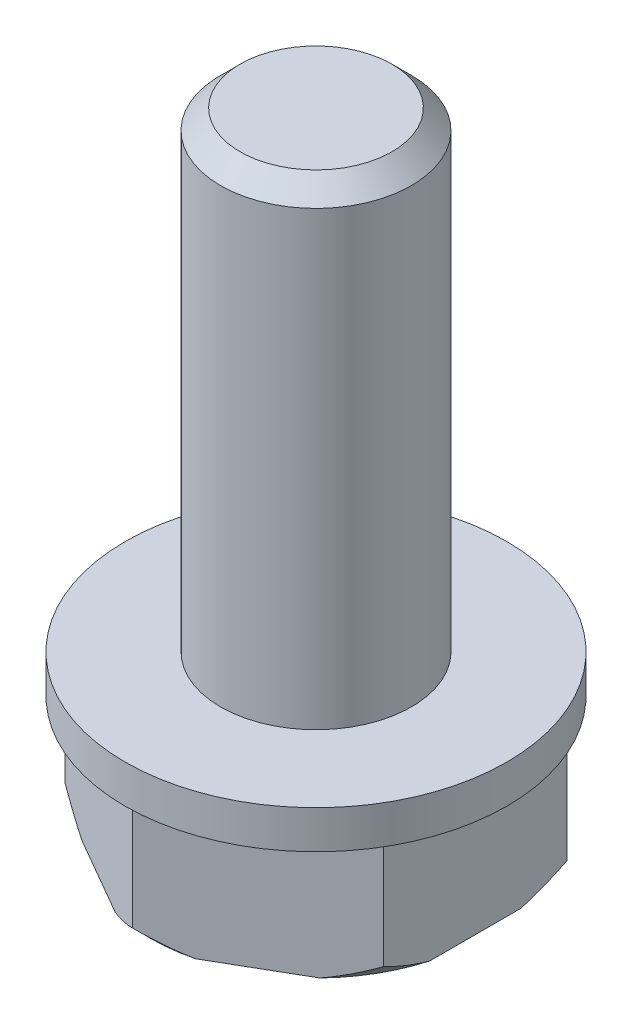
ISO-10303-21;
HEADER;
FILE_DESCRIPTION(('STEP AP214'),'2;1');
FILE_NAME('part.step','',(''),(''),'','','');
FILE_SCHEMA(('AUTOMOTIVE_DESIGN { 1 0 10303 214 1 1 1 1 }'));
ENDSEC;
DATA;
#1=APPLICATION_CONTEXT('core data for automotive mechanical design processes');
#2=APPLICATION_PROTOCOL_DEFINITION('international standard','automotive_design',2000,#1);
#3=PRODUCT_CONTEXT('',#1,'mechanical');
#4=PRODUCT('Part','Part','',(#3));
#5=PRODUCT_RELATED_PRODUCT_CATEGORY('part','',(#4));
#6=PRODUCT_DEFINITION_FORMATION('','',#4);
#7=PRODUCT_DEFINITION_CONTEXT('part definition',#1,'design');
#8=PRODUCT_DEFINITION('design','',#6,#7);
#9=PRODUCT_DEFINITION_SHAPE('','',#8);
#10=(LENGTH_UNIT() NAMED_UNIT(*) SI_UNIT(.MILLI.,.METRE.));
#11=(NAMED_UNIT(*) PLANE_ANGLE_UNIT() SI_UNIT($,.RADIAN.));
#12=(NAMED_UNIT(*) SI_UNIT($,.STERADIAN.) SOLID_ANGLE_UNIT());
#13=UNCERTAINTY_MEASURE_WITH_UNIT(LENGTH_MEASURE(1.E-05),#10,'distance_accuracy_value','');
#14=(GEOMETRIC_REPRESENTATION_CONTEXT(3) GLOBAL_UNCERTAINTY_ASSIGNED_CONTEXT((#13)) GLOBAL_UNIT_ASSIGNED_CONTEXT((#10,
#11,#12)) REPRESENTATION_CONTEXT('',''));
#15=CARTESIAN_POINT('',(0.,0.,0.));
#16=DIRECTION('',(0.,0.,1.));
#17=DIRECTION('',(1.,0.,0.));
#18=AXIS2_PLACEMENT_3D('',#15,#16,#17);
#19=CARTESIAN_POINT('',(-12.6776695296637,96.,-20.5644208756118));
#20=DIRECTION('',(-0.5,0.,0.866025403784439));
#21=DIRECTION('',(0.866025403784439,0.,0.5));
#22=AXIS2_PLACEMENT_3D('',#19,#20,#21);
#23=PLANE('',#22);
#24=DIRECTION('',(0.,-1.,0.));
#25=VECTOR('',#24,1.);
#26=CARTESIAN_POINT('',(-12.6776695296637,96.,-20.5644208756118));
#27=LINE('',#26,#25);
#28=CARTESIAN_POINT('',(-12.6776695296637,50.,-20.5644208756118));
#29=VERTEX_POINT('',#28);
#30=CARTESIAN_POINT('',(-12.6776695296637,46.5735026918963,-20.5644208756118));
#31=VERTEX_POINT('',#30);
#32=EDGE_CURVE('E11',#29,#31,#27,.T.);
#33=ORIENTED_EDGE('',*,*,#32,.T.);
#34=CARTESIAN_POINT('',(-13.9407378419784,46.,-21.2936537057316));
#35=CARTESIAN_POINT('',(-13.8888852998626,46.0164440766261,-21.2637151211004));
#36=CARTESIAN_POINT('',(-13.8372495435169,46.0337687545802,-21.2338904269128));
#37=CARTESIAN_POINT('',(-13.7338516018748,46.0702823086314,-21.1741594018992));
#38=CARTESIAN_POINT('',(-13.6820943622336,46.0894897238432,-21.1442558321939));
#39=CARTESIAN_POINT('',(-13.5783633971793,46.1297670931507,-21.0843293780453));
#40=CARTESIAN_POINT('',(-13.5263958373999,46.1508582920278,-21.054310131997));
#41=CARTESIAN_POINT('',(-13.4221600511645,46.1949003649628,-20.9941094242253));
#42=CARTESIAN_POINT('',(-13.3698991333133,46.2178745106764,-20.9639323574686));
#43=CARTESIAN_POINT('',(-13.2649997798865,46.2656807395659,-20.9033725653862));
#44=CARTESIAN_POINT('',(-13.212369709376,46.2905375181192,-20.8729948770988));
#45=CARTESIAN_POINT('',(-13.1066617384088,46.3421079012049,-20.8119895662206));
#46=CARTESIAN_POINT('',(-13.0535931424492,46.3688470805479,-20.7813674698508));
#47=CARTESIAN_POINT('',(-12.9469443837856,46.4241810640024,-20.7198294215317));
#48=CARTESIAN_POINT('',(-12.8933743396931,46.4528018406309,-20.6889193342318));
#49=CARTESIAN_POINT('',(-12.7856642307774,46.5119007649667,-20.6267615953025));
#50=CARTESIAN_POINT('',(-12.7315349477506,46.5424049416879,-20.5955199875061));
#51=CARTESIAN_POINT('',(-12.6776695296637,46.5735026918963,-20.5644208756118));
#52=B_SPLINE_CURVE_WITH_KNOTS('',3,(#34,#35,#36,#37,#38,#39,#40,#41,#42,#43,#44,#45,#46,#47,#48,
#49,#50,#51),.UNSPECIFIED.,.F.,.F.,(4,2,2,2,2,2,2,2,4),(0.,0.186265222277092,0.374595608167031,
0.565412784427949,0.759111232115716,0.956057798253881,1.15659171756844,1.36102506604506,
1.56964356219139),.UNSPECIFIED.);
#53=CARTESIAN_POINT('',(-13.9407378419784,46.,-21.2936537057316));
#54=VERTEX_POINT('',#53);
#55=EDGE_CURVE('E254',#54,#31,#52,.T.);
#56=ORIENTED_EDGE('',*,*,#55,.F.);
#57=DIRECTION('',(0.866025403784439,0.,0.5));
#58=VECTOR('',#57,1.);
#59=CARTESIAN_POINT('',(-11.2776695296637,46.,-19.7561304987464));
#60=LINE('',#59,#58);
#61=CARTESIAN_POINT('',(-16.414601217349,46.,-22.7219393914402));
#62=VERTEX_POINT('',#61);
#63=EDGE_CURVE('E259',#62,#54,#60,.T.);
#64=ORIENTED_EDGE('',*,*,#63,.F.);
#65=CARTESIAN_POINT('',(-17.6776695296637,46.5735026918963,-23.45117222156));
#66=CARTESIAN_POINT('',(-17.6238041996847,46.5424049416879,-23.4200729570583));
#67=CARTESIAN_POINT('',(-17.5696835321645,46.5119007649667,-23.3888164267667));
#68=CARTESIAN_POINT('',(-17.4619982967521,46.4528018406309,-23.326615605666));
#69=CARTESIAN_POINT('',(-17.4084443538709,46.4241810640024,-23.29567763025));
#70=CARTESIAN_POINT('',(-17.3018264613955,46.3688470805479,-23.2340861201248));
#71=CARTESIAN_POINT('',(-17.2487726500423,46.3421079012049,-23.2034384160655));
#72=CARTESIAN_POINT('',(-17.1430865155724,46.2905375181192,-23.1423952832645));
#73=CARTESIAN_POINT('',(-17.090463630552,46.2656807395659,-23.1120051493432));
#74=CARTESIAN_POINT('',(-16.9855676354473,46.2178745106764,-23.0514395404762));
#75=CARTESIAN_POINT('',(-16.9333030700988,46.1949003649628,-23.0212687913703));
#76=CARTESIAN_POINT('',(-16.829049834725,46.1508582920278,-22.9610983063928));
#77=CARTESIAN_POINT('',(-16.7770686251549,46.1297670931507,-22.9311027024754));
#78=CARTESIAN_POINT('',(-16.6733053109764,46.0894897238432,-22.8712322786535));
#79=CARTESIAN_POINT('',(-16.6215294401272,46.0702823086314,-22.8413609791471));
#80=CARTESIAN_POINT('',(-16.5181018842503,46.0337687545802,-22.7816812474928));
#81=CARTESIAN_POINT('',(-16.4664550632509,46.0164440766261,-22.7518757178476));
#82=CARTESIAN_POINT('',(-16.414601217349,46.,-22.7219393914402));
#83=B_SPLINE_CURVE_WITH_KNOTS('',3,(#65,#66,#67,#68,#69,#70,#71,#72,#73,#74,#75,#76,#77,#78,#79,
#80,#81,#82),.UNSPECIFIED.,.F.,.F.,(4,2,2,2,2,2,2,2,4),(0.,0.208618496146344,0.413051844622971,
0.613585763937533,0.810532330075705,1.00423077776347,1.19504795402439,1.38337833991431,
1.56964356219139),.UNSPECIFIED.);
#84=CARTESIAN_POINT('',(-17.6776695296637,46.5735026918963,-23.4511722215599));
#85=VERTEX_POINT('',#84);
#86=EDGE_CURVE('E467',#85,#62,#83,.T.);
#87=ORIENTED_EDGE('',*,*,#86,.F.);
#88=DIRECTION('',(0.,-1.,0.));
#89=VECTOR('',#88,1.);
#90=CARTESIAN_POINT('',(-17.6776695296637,96.,-23.4511722215599));
#91=LINE('',#90,#89);
#92=CARTESIAN_POINT('',(-17.6776695296637,50.,-23.4511722215599));
#93=VERTEX_POINT('',#92);
#94=EDGE_CURVE('E280',#93,#85,#91,.T.);
#95=ORIENTED_EDGE('',*,*,#94,.F.);
#96=DIRECTION('',(-0.866025403784439,0.,-0.5));
#97=VECTOR('',#96,1.);
#98=CARTESIAN_POINT('',(-12.9276695296637,50.,-20.7087584429092));
#99=LINE('',#98,#97);
#100=EDGE_CURVE('E446',#29,#93,#99,.T.);
#101=ORIENTED_EDGE('',*,*,#100,.F.);
#102=EDGE_LOOP('',(#33,#56,#64,#87,#95,#101));
#103=FACE_BOUND('',#102,.T.);
#104=ADVANCED_FACE('F16',(#103),#23,.F.);
#105=CARTESIAN_POINT('',(-12.6776695296637,96.,-14.7909181837156));
#106=DIRECTION('',(-1.,0.,0.));
#107=DIRECTION('',(0.,0.,1.));
#108=AXIS2_PLACEMENT_3D('',#105,#106,#107);
#109=PLANE('',#108);
#110=DIRECTION('',(0.,-1.,0.));
#111=VECTOR('',#110,1.);
#112=CARTESIAN_POINT('',(-12.6776695296637,96.,-14.7909181837156));
#113=LINE('',#112,#111);
#114=CARTESIAN_POINT('',(-12.6776695296637,50.,-14.7909181837156));
#115=VERTEX_POINT('',#114);
#116=CARTESIAN_POINT('',(-12.6776695296637,46.5735026918963,-14.7909181837156));
#117=VERTEX_POINT('',#116);
#118=EDGE_CURVE('E214',#115,#117,#113,.T.);
#119=ORIENTED_EDGE('',*,*,#118,.T.);
#120=CARTESIAN_POINT('',(-12.6776695296637,46.,-16.2493838439551));
#121=CARTESIAN_POINT('',(-12.6776708334498,46.0164440766261,-16.1895089329165));
#122=CARTESIAN_POINT('',(-12.6776818981035,46.0337687545802,-16.1298787090837));
#123=CARTESIAN_POINT('',(-12.6777115123383,46.0702823086314,-16.0104679524158));
#124=CARTESIAN_POINT('',(-12.6777301435463,46.0894897238432,-15.9506930832041));
#125=CARTESIAN_POINT('',(-12.6777624926705,46.1297670931507,-15.8308962052337));
#126=CARTESIAN_POINT('',(-12.6777761424612,46.1508582920278,-15.7708813552678));
#127=CARTESIAN_POINT('',(-12.6777935915996,46.1949003649628,-15.6505101625187));
#128=CARTESIAN_POINT('',(-12.677797239097,46.2178745106764,-15.5901623466562));
#129=CARTESIAN_POINT('',(-12.6777938807748,46.2656807395659,-15.4690369457068));
#130=CARTESIAN_POINT('',(-12.6777866952847,46.2905375181192,-15.4082691234981));
#131=CARTESIAN_POINT('',(-12.6777648587874,46.3421079012049,-15.2862206798188));
#132=CARTESIAN_POINT('',(-12.677750074181,46.3688470805479,-15.2249508793897));
#133=CARTESIAN_POINT('',(-12.6777192079928,46.4241810640024,-15.1018213209455));
#134=CARTESIAN_POINT('',(-12.6777031067814,46.4528018406309,-15.0399732582295));
#135=CARTESIAN_POINT('',(-12.6776782332782,46.5119007649667,-14.9156146981995));
#136=CARTESIAN_POINT('',(-12.6776696177716,46.542404941688,-14.8531165601115));
#137=CARTESIAN_POINT('',(-12.6776695296637,46.5735026918963,-14.7909181837156));
#138=B_SPLINE_CURVE_WITH_KNOTS('',3,(#120,#121,#122,#123,#124,#125,#126,#127,#128,#129,#130,
#131,#132,#133,#134,#135,#136,#137),.UNSPECIFIED.,.F.,.F.,(4,2,2,2,2,2,2,2,4),(0.,
0.186265222277086,0.37459560816702,0.565412784427932,0.759111232115697,0.956057798253867,
1.15659171756842,1.36102506604504,1.56964356219138),.UNSPECIFIED.);
#139=CARTESIAN_POINT('',(-12.6776695296637,46.,-16.2493838439551));
#140=VERTEX_POINT('',#139);
#141=EDGE_CURVE('E28',#140,#117,#138,.T.);
#142=ORIENTED_EDGE('',*,*,#141,.F.);
#143=DIRECTION('',(0.,0.,1.));
#144=VECTOR('',#143,1.);
#145=CARTESIAN_POINT('',(-12.6776695296637,46.,-17.6776695296637));
#146=LINE('',#145,#144);
#147=CARTESIAN_POINT('',(-12.6776695296637,46.,-19.1059552153723));
#148=VERTEX_POINT('',#147);
#149=EDGE_CURVE('E201',#148,#140,#146,.T.);
#150=ORIENTED_EDGE('',*,*,#149,.F.);
#151=CARTESIAN_POINT('',(-12.6776695296637,46.5735026918963,-20.5644208756118));
#152=CARTESIAN_POINT('',(-12.6776696177716,46.5424049416879,-20.502222499216));
#153=CARTESIAN_POINT('',(-12.6776782332782,46.5119007649667,-20.4397243611279));
#154=CARTESIAN_POINT('',(-12.6777031067814,46.4528018406309,-20.3153658010979));
#155=CARTESIAN_POINT('',(-12.6777192079928,46.4241810640024,-20.2535177383819));
#156=CARTESIAN_POINT('',(-12.677750074181,46.3688470805479,-20.1303881799377));
#157=CARTESIAN_POINT('',(-12.6777648587874,46.3421079012049,-20.0691183795086));
#158=CARTESIAN_POINT('',(-12.6777866952847,46.2905375181192,-19.9470699358293));
#159=CARTESIAN_POINT('',(-12.6777938807748,46.2656807395659,-19.8863021136206));
#160=CARTESIAN_POINT('',(-12.677797239097,46.2178745106764,-19.7651767126712));
#161=CARTESIAN_POINT('',(-12.6777935915996,46.1949003649628,-19.7048288968087));
#162=CARTESIAN_POINT('',(-12.6777761424612,46.1508582920278,-19.5844577040595));
#163=CARTESIAN_POINT('',(-12.6777624926706,46.1297670931507,-19.5244428540937));
#164=CARTESIAN_POINT('',(-12.6777301435463,46.0894897238432,-19.4046459761233));
#165=CARTESIAN_POINT('',(-12.6777115123383,46.0702823086314,-19.3448711069116));
#166=CARTESIAN_POINT('',(-12.6776818981035,46.0337687545802,-19.2254603502437));
#167=CARTESIAN_POINT('',(-12.6776708334498,46.0164440766261,-19.1658301264109));
#168=CARTESIAN_POINT('',(-12.6776695296637,46.,-19.1059552153723));
#169=B_SPLINE_CURVE_WITH_KNOTS('',3,(#151,#152,#153,#154,#155,#156,#157,#158,#159,#160,#161,
#162,#163,#164,#165,#166,#167,#168),.UNSPECIFIED.,.F.,.F.,(4,2,2,2,2,2,2,2,4),(0.,
0.208618496146355,0.41305184462299,0.613585763937555,0.810532330075726,1.00423077776349,
1.19504795402439,1.38337833991431,1.56964356219138),.UNSPECIFIED.);
#170=EDGE_CURVE('E108',#31,#148,#169,.T.);
#171=ORIENTED_EDGE('',*,*,#170,.F.);
#172=ORIENTED_EDGE('',*,*,#32,.F.);
#173=DIRECTION('',(0.,0.,-1.));
#174=VECTOR('',#173,1.);
#175=CARTESIAN_POINT('',(-12.6776695296637,50.,-17.6776695296637));
#176=LINE('',#175,#174);
#177=EDGE_CURVE('E442',#115,#29,#176,.T.);
#178=ORIENTED_EDGE('',*,*,#177,.F.);
#179=EDGE_LOOP('',(#119,#142,#150,#171,#172,#178));
#180=FACE_BOUND('',#179,.T.);
#181=ADVANCED_FACE('F237',(#180),#109,.F.);
#182=CARTESIAN_POINT('',(-17.6776695296637,46.8,-17.6776695296637));
#183=DIRECTION('',(0.,1.,0.));
#184=DIRECTION('',(0.,0.,1.));
#185=AXIS2_PLACEMENT_3D('',#182,#183,#184);
#186=CONICAL_SURFACE('',#185,6.,0.785398163397448);
#187=CARTESIAN_POINT('',(-17.6776695296637,46.,-17.6776695296637));
#188=DIRECTION('',(0.,-1.,0.));
#189=DIRECTION('',(0.,0.,-1.));
#190=AXIS2_PLACEMENT_3D('',#187,#188,#189);
#191=CIRCLE('',#190,5.2);
#192=CARTESIAN_POINT('',(-13.9407378419784,46.,-14.0616853535958));
#193=VERTEX_POINT('',#192);
#194=EDGE_CURVE('E70',#140,#193,#191,.T.);
#195=ORIENTED_EDGE('',*,*,#194,.F.);
#196=ORIENTED_EDGE('',*,*,#141,.T.);
#197=CARTESIAN_POINT('',(-12.6776695296637,46.5735026918963,-14.7909181837156));
#198=CARTESIAN_POINT('',(-12.7315349477506,46.542404941688,-14.7598190718213));
#199=CARTESIAN_POINT('',(-12.7856642307774,46.5119007649667,-14.7285774640249));
#200=CARTESIAN_POINT('',(-12.8933743396931,46.4528018406309,-14.6664197250956));
#201=CARTESIAN_POINT('',(-12.9469443837857,46.4241810640024,-14.6355096377956));
#202=CARTESIAN_POINT('',(-13.0535931424492,46.3688470805479,-14.5739715894766));
#203=CARTESIAN_POINT('',(-13.1066617384088,46.3421079012049,-14.5433494931068));
#204=CARTESIAN_POINT('',(-13.212369709376,46.2905375181192,-14.4823441822286));
#205=CARTESIAN_POINT('',(-13.2649997798865,46.2656807395659,-14.4519664939412));
#206=CARTESIAN_POINT('',(-13.3698991333133,46.2178745106764,-14.3914067018588));
#207=CARTESIAN_POINT('',(-13.4221600511645,46.1949003649628,-14.3612296351021));
#208=CARTESIAN_POINT('',(-13.5263958373999,46.1508582920278,-14.3010289273304));
#209=CARTESIAN_POINT('',(-13.5783633971793,46.1297670931507,-14.271009681282));
#210=CARTESIAN_POINT('',(-13.6820943622336,46.0894897238432,-14.2110832271335));
#211=CARTESIAN_POINT('',(-13.7338516018749,46.0702823086314,-14.1811796574282));
#212=CARTESIAN_POINT('',(-13.8372495435169,46.0337687545802,-14.1214486324146));
#213=CARTESIAN_POINT('',(-13.8888852998626,46.0164440766261,-14.091623938227));
#214=CARTESIAN_POINT('',(-13.9407378419784,46.,-14.0616853535958));
#215=B_SPLINE_CURVE_WITH_KNOTS('',3,(#197,#198,#199,#200,#201,#202,#203,#204,#205,#206,#207,
#208,#209,#210,#211,#212,#213,#214),.UNSPECIFIED.,.F.,.F.,(4,2,2,2,2,2,2,2,4),(0.,
0.208618496146345,0.413051844622975,0.613585763937534,0.810532330075705,1.00423077776347,
1.19504795402438,1.3833783399143,1.56964356219138),.UNSPECIFIED.);
#216=EDGE_CURVE('E217',#117,#193,#215,.T.);
#217=ORIENTED_EDGE('',*,*,#216,.T.);
#218=EDGE_LOOP('',(#195,#196,#217));
#219=FACE_BOUND('',#218,.T.);
#220=ADVANCED_FACE('F235',(#219),#186,.T.);
#221=CARTESIAN_POINT('',(-17.6776695296637,46.8,-17.6776695296637));
#222=DIRECTION('',(0.,1.,0.));
#223=DIRECTION('',(0.,0.,1.));
#224=AXIS2_PLACEMENT_3D('',#221,#222,#223);
#225=CONICAL_SURFACE('',#224,6.,0.785398163397448);
#226=CARTESIAN_POINT('',(-17.6776695296637,46.,-17.6776695296637));
#227=DIRECTION('',(0.,-1.,0.));
#228=DIRECTION('',(0.,0.,-1.));
#229=AXIS2_PLACEMENT_3D('',#226,#227,#228);
#230=CIRCLE('',#229,5.2);
#231=EDGE_CURVE('E203',#54,#148,#230,.T.);
#232=ORIENTED_EDGE('',*,*,#231,.F.);
#233=ORIENTED_EDGE('',*,*,#55,.T.);
#234=ORIENTED_EDGE('',*,*,#170,.T.);
#235=EDGE_LOOP('',(#232,#233,#234));
#236=FACE_BOUND('',#235,.T.);
#237=ADVANCED_FACE('F225',(#236),#225,.T.);
#238=CARTESIAN_POINT('',(-17.6776695296637,46.8,-17.6776695296637));
#239=DIRECTION('',(0.,1.,0.));
#240=DIRECTION('',(0.,0.,1.));
#241=AXIS2_PLACEMENT_3D('',#238,#239,#240);
#242=CONICAL_SURFACE('',#241,6.,0.785398163397448);
#243=CARTESIAN_POINT('',(-17.6776695296637,46.,-17.6776695296637));
#244=DIRECTION('',(0.,-1.,0.));
#245=DIRECTION('',(0.,0.,-1.));
#246=AXIS2_PLACEMENT_3D('',#243,#244,#245);
#247=CIRCLE('',#246,5.2);
#248=CARTESIAN_POINT('',(-18.9407378419784,46.,-22.7219393914402));
#249=VERTEX_POINT('',#248);
#250=EDGE_CURVE('E292',#249,#62,#247,.T.);
#251=ORIENTED_EDGE('',*,*,#250,.F.);
#252=CARTESIAN_POINT('',(-18.9407378419784,46.,-22.7219393914402));
#253=CARTESIAN_POINT('',(-18.8888839960765,46.0164440766261,-22.7518757178476));
#254=CARTESIAN_POINT('',(-18.8372371750771,46.0337687545802,-22.7816812474928));
#255=CARTESIAN_POINT('',(-18.7338096192002,46.0702823086314,-22.8413609791471));
#256=CARTESIAN_POINT('',(-18.682033748351,46.0894897238432,-22.8712322786535));
#257=CARTESIAN_POINT('',(-18.5782704341724,46.1297670931507,-22.9311027024754));
#258=CARTESIAN_POINT('',(-18.5262892246024,46.1508582920278,-22.9610983063928));
#259=CARTESIAN_POINT('',(-18.4220359892286,46.1949003649628,-23.0212687913703));
#260=CARTESIAN_POINT('',(-18.36977142388,46.2178745106764,-23.0514395404762));
#261=CARTESIAN_POINT('',(-18.2648754287754,46.2656807395659,-23.1120051493432));
#262=CARTESIAN_POINT('',(-18.212252543755,46.2905375181192,-23.1423952832645));
#263=CARTESIAN_POINT('',(-18.1065664092851,46.3421079012049,-23.2034384160655));
#264=CARTESIAN_POINT('',(-18.0535125979319,46.3688470805479,-23.2340861201248));
#265=CARTESIAN_POINT('',(-17.9468947054565,46.4241810640024,-23.29567763025));
#266=CARTESIAN_POINT('',(-17.8933407625753,46.4528018406309,-23.326615605666));
#267=CARTESIAN_POINT('',(-17.7856555271629,46.5119007649667,-23.3888164267667));
#268=CARTESIAN_POINT('',(-17.7315348596427,46.5424049416879,-23.4200729570583));
#269=CARTESIAN_POINT('',(-17.6776695296637,46.5735026918963,-23.45117222156));
#270=B_SPLINE_CURVE_WITH_KNOTS('',3,(#252,#253,#254,#255,#256,#257,#258,#259,#260,#261,#262,
#263,#264,#265,#266,#267,#268,#269),.UNSPECIFIED.,.F.,.F.,(4,2,2,2,2,2,2,2,4),(0.,
0.186265222277085,0.37459560816702,0.565412784427932,0.759111232115701,0.956057798253871,
1.15659171756843,1.36102506604505,1.56964356219139),.UNSPECIFIED.);
#271=EDGE_CURVE('E288',#249,#85,#270,.T.);
#272=ORIENTED_EDGE('',*,*,#271,.T.);
#273=ORIENTED_EDGE('',*,*,#86,.T.);
#274=EDGE_LOOP('',(#251,#272,#273));
#275=FACE_BOUND('',#274,.T.);
#276=ADVANCED_FACE('F234',(#275),#242,.T.);
#277=CARTESIAN_POINT('',(-17.6776695296637,51.2,-17.6776695296637));
#278=DIRECTION('',(0.,-1.,0.));
#279=DIRECTION('',(0.,0.,-1.));
#280=AXIS2_PLACEMENT_3D('',#277,#278,#279);
#281=PLANE('',#280);
#282=CARTESIAN_POINT('',(-17.6776695296637,51.2,-17.6776695296637));
#283=DIRECTION('',(0.,-1.,0.));
#284=DIRECTION('',(0.,0.,-1.));
#285=AXIS2_PLACEMENT_3D('',#282,#283,#284);
#286=CIRCLE('',#285,3.);
#287=CARTESIAN_POINT('',(-17.6776695296637,51.2,-20.6776695296637));
#288=VERTEX_POINT('',#287);
#289=EDGE_CURVE('E200',#288,#288,#286,.T.);
#290=ORIENTED_EDGE('',*,*,#289,.T.);
#291=EDGE_LOOP('',(#290));
#292=FACE_BOUND('',#291,.T.);
#293=CARTESIAN_POINT('',(-17.6776695296637,51.2,-17.6776695296637));
#294=DIRECTION('',(0.,-1.,0.));
#295=DIRECTION('',(0.,0.,-1.));
#296=AXIS2_PLACEMENT_3D('',#293,#294,#295);
#297=CIRCLE('',#296,6.);
#298=CARTESIAN_POINT('',(-17.6776695296637,51.2,-23.6776695296637));
#299=VERTEX_POINT('',#298);
#300=EDGE_CURVE('E466',#299,#299,#297,.T.);
#301=ORIENTED_EDGE('',*,*,#300,.F.);
#302=EDGE_LOOP('',(#301));
#303=FACE_BOUND('',#302,.T.);
#304=ADVANCED_FACE('F332',(#292,#303),#281,.F.);
#305=CARTESIAN_POINT('',(-17.6776695296637,46.8,-17.6776695296637));
#306=DIRECTION('',(0.,1.,0.));
#307=DIRECTION('',(0.,0.,1.));
#308=AXIS2_PLACEMENT_3D('',#305,#306,#307);
#309=CONICAL_SURFACE('',#308,6.,0.785398163397448);
#310=CARTESIAN_POINT('',(-17.6776695296637,46.,-17.6776695296637));
#311=DIRECTION('',(0.,-1.,0.));
#312=DIRECTION('',(0.,0.,-1.));
#313=AXIS2_PLACEMENT_3D('',#310,#311,#312);
#314=CIRCLE('',#313,5.2);
#315=CARTESIAN_POINT('',(-22.6776695296637,46.,-19.1059552153723));
#316=VERTEX_POINT('',#315);
#317=CARTESIAN_POINT('',(-21.414601217349,46.,-21.2936537057316));
#318=VERTEX_POINT('',#317);
#319=EDGE_CURVE('E524',#316,#318,#314,.T.);
#320=ORIENTED_EDGE('',*,*,#319,.F.);
#321=CARTESIAN_POINT('',(-22.6776695296637,46.,-19.1059552153723));
#322=CARTESIAN_POINT('',(-22.6776682258776,46.0164440766261,-19.165830126411));
#323=CARTESIAN_POINT('',(-22.6776571612239,46.0337687545802,-19.2254603502438));
#324=CARTESIAN_POINT('',(-22.6776275469891,46.0702823086314,-19.3448711069116));
#325=CARTESIAN_POINT('',(-22.6776089157811,46.0894897238432,-19.4046459761234));
#326=CARTESIAN_POINT('',(-22.6775765666569,46.1297670931507,-19.5244428540937));
#327=CARTESIAN_POINT('',(-22.6775629168662,46.1508582920278,-19.5844577040596));
#328=CARTESIAN_POINT('',(-22.6775454677278,46.1949003649628,-19.7048288968087));
#329=CARTESIAN_POINT('',(-22.6775418202304,46.2178745106764,-19.7651767126713));
#330=CARTESIAN_POINT('',(-22.6775451785526,46.2656807395659,-19.8863021136206));
#331=CARTESIAN_POINT('',(-22.6775523640427,46.2905375181192,-19.9470699358293));
#332=CARTESIAN_POINT('',(-22.67757420054,46.3421079012049,-20.0691183795086));
#333=CARTESIAN_POINT('',(-22.6775889851464,46.3688470805479,-20.1303881799377));
#334=CARTESIAN_POINT('',(-22.6776198513346,46.4241810640024,-20.2535177383819));
#335=CARTESIAN_POINT('',(-22.677635952546,46.4528018406309,-20.3153658010979));
#336=CARTESIAN_POINT('',(-22.6776608260492,46.5119007649667,-20.4397243611279));
#337=CARTESIAN_POINT('',(-22.6776694415558,46.542404941688,-20.502222499216));
#338=CARTESIAN_POINT('',(-22.6776695296637,46.5735026918963,-20.5644208756118));
#339=B_SPLINE_CURVE_WITH_KNOTS('',3,(#321,#322,#323,#324,#325,#326,#327,#328,#329,#330,#331,
#332,#333,#334,#335,#336,#337,#338),.UNSPECIFIED.,.F.,.F.,(4,2,2,2,2,2,2,2,4),(0.,
0.186265222277079,0.37459560816701,0.565412784427918,0.759111232115676,0.956057798253847,
1.15659171756841,1.36102506604503,1.56964356219137),.UNSPECIFIED.);
#340=CARTESIAN_POINT('',(-22.6776695296637,46.5735026918963,-20.5644208756118));
#341=VERTEX_POINT('',#340);
#342=EDGE_CURVE('E289',#316,#341,#339,.T.);
#343=ORIENTED_EDGE('',*,*,#342,.T.);
#344=CARTESIAN_POINT('',(-22.6776695296637,46.5735026918963,-20.5644208756118));
#345=CARTESIAN_POINT('',(-22.6238041115768,46.542404941688,-20.5955199875061));
#346=CARTESIAN_POINT('',(-22.56967482855,46.5119007649667,-20.6267615953026));
#347=CARTESIAN_POINT('',(-22.4619647196343,46.4528018406309,-20.6889193342319));
#348=CARTESIAN_POINT('',(-22.4083946755417,46.4241810640024,-20.7198294215318));
#349=CARTESIAN_POINT('',(-22.3017459168782,46.3688470805479,-20.7813674698508));
#350=CARTESIAN_POINT('',(-22.2486773209186,46.3421079012049,-20.8119895662206));
#351=CARTESIAN_POINT('',(-22.1429693499514,46.2905375181192,-20.8729948770988));
#352=CARTESIAN_POINT('',(-22.0903392794409,46.2656807395659,-20.9033725653862));
#353=CARTESIAN_POINT('',(-21.9854399260141,46.2178745106764,-20.9639323574686));
#354=CARTESIAN_POINT('',(-21.9331790081629,46.1949003649628,-20.9941094242253));
#355=CARTESIAN_POINT('',(-21.8289432219275,46.1508582920278,-21.054310131997));
#356=CARTESIAN_POINT('',(-21.7769756621481,46.1297670931507,-21.0843293780454));
#357=CARTESIAN_POINT('',(-21.6732446970938,46.0894897238432,-21.1442558321939));
#358=CARTESIAN_POINT('',(-21.6214874574525,46.0702823086314,-21.1741594018992));
#359=CARTESIAN_POINT('',(-21.5180895158105,46.0337687545802,-21.2338904269128));
#360=CARTESIAN_POINT('',(-21.4664537594648,46.0164440766261,-21.2637151211004));
#361=CARTESIAN_POINT('',(-21.414601217349,46.,-21.2936537057316));
#362=B_SPLINE_CURVE_WITH_KNOTS('',3,(#344,#345,#346,#347,#348,#349,#350,#351,#352,#353,#354,
#355,#356,#357,#358,#359,#360,#361),.UNSPECIFIED.,.F.,.F.,(4,2,2,2,2,2,2,2,4),(0.,
0.208618496146346,0.413051844622975,0.613585763937533,0.810532330075706,1.00423077776347,
1.19504795402437,1.3833783399143,1.56964356219137),.UNSPECIFIED.);
#363=EDGE_CURVE('E303',#341,#318,#362,.T.);
#364=ORIENTED_EDGE('',*,*,#363,.T.);
#365=EDGE_LOOP('',(#320,#343,#364));
#366=FACE_BOUND('',#365,.T.);
#367=ADVANCED_FACE('F173',(#366),#309,.T.);
#368=CARTESIAN_POINT('',(-17.6776695296637,50.,-17.6776695296637));
#369=DIRECTION('',(0.,-1.,0.));
#370=DIRECTION('',(0.,0.,-1.));
#371=AXIS2_PLACEMENT_3D('',#368,#369,#370);
#372=CYLINDRICAL_SURFACE('',#371,6.);
#373=ORIENTED_EDGE('',*,*,#300,.T.);
#374=EDGE_LOOP('',(#373));
#375=FACE_BOUND('',#374,.T.);
#376=CARTESIAN_POINT('',(-17.6776695296637,50.,-17.6776695296637));
#377=DIRECTION('',(0.,-1.,0.));
#378=DIRECTION('',(0.,0.,-1.));
#379=AXIS2_PLACEMENT_3D('',#376,#377,#378);
#380=CIRCLE('',#379,6.);
#381=CARTESIAN_POINT('',(-17.6776695296637,50.,-23.6776695296637));
#382=VERTEX_POINT('',#381);
#383=EDGE_CURVE('E461',#382,#382,#380,.T.);
#384=ORIENTED_EDGE('',*,*,#383,.F.);
#385=EDGE_LOOP('',(#384));
#386=FACE_BOUND('',#385,.T.);
#387=ADVANCED_FACE('F331',(#375,#386),#372,.T.);
#388=CARTESIAN_POINT('',(-17.6776695296637,96.,-23.4511722215599));
#389=DIRECTION('',(0.5,0.,0.866025403784439));
#390=DIRECTION('',(0.866025403784439,0.,-0.5));
#391=AXIS2_PLACEMENT_3D('',#388,#389,#390);
#392=PLANE('',#391);
#393=ORIENTED_EDGE('',*,*,#94,.T.);
#394=ORIENTED_EDGE('',*,*,#271,.F.);
#395=DIRECTION('',(0.866025403784439,0.,-0.5));
#396=VECTOR('',#395,1.);
#397=CARTESIAN_POINT('',(-16.2776695296637,46.,-24.2594625984254));
#398=LINE('',#397,#396);
#399=EDGE_CURVE('E295',#318,#249,#398,.T.);
#400=ORIENTED_EDGE('',*,*,#399,.F.);
#401=ORIENTED_EDGE('',*,*,#363,.F.);
#402=DIRECTION('',(0.,-1.,0.));
#403=VECTOR('',#402,1.);
#404=CARTESIAN_POINT('',(-22.6776695296637,96.,-20.5644208756118));
#405=LINE('',#404,#403);
#406=CARTESIAN_POINT('',(-22.6776695296637,50.,-20.5644208756118));
#407=VERTEX_POINT('',#406);
#408=EDGE_CURVE('E319',#407,#341,#405,.T.);
#409=ORIENTED_EDGE('',*,*,#408,.F.);
#410=DIRECTION('',(-0.866025403784439,0.,0.5));
#411=VECTOR('',#410,1.);
#412=CARTESIAN_POINT('',(-17.9276695296637,50.,-23.3068346542625));
#413=LINE('',#412,#411);
#414=EDGE_CURVE('E457',#93,#407,#413,.T.);
#415=ORIENTED_EDGE('',*,*,#414,.F.);
#416=EDGE_LOOP('',(#393,#394,#400,#401,#409,#415));
#417=FACE_BOUND('',#416,.T.);
#418=ADVANCED_FACE('F321',(#417),#392,.F.);
#419=CARTESIAN_POINT('',(-22.6776695296637,96.,-20.5644208756118));
#420=DIRECTION('',(1.,0.,0.));
#421=DIRECTION('',(0.,0.,-1.));
#422=AXIS2_PLACEMENT_3D('',#419,#420,#421);
#423=PLANE('',#422);
#424=ORIENTED_EDGE('',*,*,#408,.T.);
#425=ORIENTED_EDGE('',*,*,#342,.F.);
#426=DIRECTION('',(0.,0.,-1.));
#427=VECTOR('',#426,1.);
#428=CARTESIAN_POINT('',(-22.6776695296637,46.,-17.6776695296637));
#429=LINE('',#428,#427);
#430=CARTESIAN_POINT('',(-22.6776695296637,46.,-16.2493838439551));
#431=VERTEX_POINT('',#430);
#432=EDGE_CURVE('E140',#431,#316,#429,.T.);
#433=ORIENTED_EDGE('',*,*,#432,.F.);
#434=CARTESIAN_POINT('',(-22.6776695296637,46.5735026918963,-14.7909181837156));
#435=CARTESIAN_POINT('',(-22.6776694415558,46.5424049416879,-14.8531165601114));
#436=CARTESIAN_POINT('',(-22.6776608260492,46.5119007649667,-14.9156146981995));
#437=CARTESIAN_POINT('',(-22.677635952546,46.4528018406309,-15.0399732582295));
#438=CARTESIAN_POINT('',(-22.6776198513346,46.4241810640024,-15.1018213209455));
#439=CARTESIAN_POINT('',(-22.6775889851464,46.3688470805479,-15.2249508793897));
#440=CARTESIAN_POINT('',(-22.67757420054,46.3421079012049,-15.2862206798188));
#441=CARTESIAN_POINT('',(-22.6775523640427,46.2905375181192,-15.4082691234981));
#442=CARTESIAN_POINT('',(-22.6775451785526,46.2656807395659,-15.4690369457068));
#443=CARTESIAN_POINT('',(-22.6775418202304,46.2178745106764,-15.5901623466562));
#444=CARTESIAN_POINT('',(-22.6775454677278,46.1949003649628,-15.6505101625188));
#445=CARTESIAN_POINT('',(-22.6775629168662,46.1508582920278,-15.7708813552679));
#446=CARTESIAN_POINT('',(-22.6775765666568,46.1297670931507,-15.8308962052337));
#447=CARTESIAN_POINT('',(-22.6776089157811,46.0894897238432,-15.9506930832041));
#448=CARTESIAN_POINT('',(-22.6776275469891,46.0702823086314,-16.0104679524158));
#449=CARTESIAN_POINT('',(-22.6776571612239,46.0337687545802,-16.1298787090837));
#450=CARTESIAN_POINT('',(-22.6776682258776,46.0164440766261,-16.1895089329164));
#451=CARTESIAN_POINT('',(-22.6776695296637,46.,-16.2493838439551));
#452=B_SPLINE_CURVE_WITH_KNOTS('',3,(#434,#435,#436,#437,#438,#439,#440,#441,#442,#443,#444,
#445,#446,#447,#448,#449,#450,#451),.UNSPECIFIED.,.F.,.F.,(4,2,2,2,2,2,2,2,4),(0.,
0.208618496146364,0.413051844623001,0.613585763937566,0.810532330075742,1.0042307777635,
1.1950479540244,1.38337833991432,1.56964356219138),.UNSPECIFIED.);
#453=CARTESIAN_POINT('',(-22.6776695296637,46.5735026918963,-14.7909181837156));
#454=VERTEX_POINT('',#453);
#455=EDGE_CURVE('E136',#454,#431,#452,.T.);
#456=ORIENTED_EDGE('',*,*,#455,.F.);
#457=DIRECTION('',(0.,-1.,0.));
#458=VECTOR('',#457,1.);
#459=CARTESIAN_POINT('',(-22.6776695296637,96.,-14.7909181837156));
#460=LINE('',#459,#458);
#461=CARTESIAN_POINT('',(-22.6776695296637,50.,-14.7909181837156));
#462=VERTEX_POINT('',#461);
#463=EDGE_CURVE('E153',#462,#454,#460,.T.);
#464=ORIENTED_EDGE('',*,*,#463,.F.);
#465=DIRECTION('',(0.,0.,1.));
#466=VECTOR('',#465,1.);
#467=CARTESIAN_POINT('',(-22.6776695296637,50.,-17.6776695296637));
#468=LINE('',#467,#466);
#469=EDGE_CURVE('E459',#407,#462,#468,.T.);
#470=ORIENTED_EDGE('',*,*,#469,.F.);
#471=EDGE_LOOP('',(#424,#425,#433,#456,#464,#470));
#472=FACE_BOUND('',#471,.T.);
#473=ADVANCED_FACE('F330',(#472),#423,.F.);
#474=CARTESIAN_POINT('',(-11.6776695296637,50.,-17.6776695296637));
#475=DIRECTION('',(0.,1.,0.));
#476=DIRECTION('',(0.,0.,1.));
#477=AXIS2_PLACEMENT_3D('',#474,#475,#476);
#478=PLANE('',#477);
#479=ORIENTED_EDGE('',*,*,#383,.T.);
#480=EDGE_LOOP('',(#479));
#481=FACE_BOUND('',#480,.T.);
#482=ORIENTED_EDGE('',*,*,#177,.T.);
#483=ORIENTED_EDGE('',*,*,#100,.T.);
#484=ORIENTED_EDGE('',*,*,#414,.T.);
#485=ORIENTED_EDGE('',*,*,#469,.T.);
#486=DIRECTION('',(0.866025403784439,0.,0.5));
#487=VECTOR('',#486,1.);
#488=CARTESIAN_POINT('',(-17.9276695296637,50.,-12.0485044050648));
#489=LINE('',#488,#487);
#490=CARTESIAN_POINT('',(-17.6776695296637,50.,-11.9041668377674));
#491=VERTEX_POINT('',#490);
#492=EDGE_CURVE('E141',#462,#491,#489,.T.);
#493=ORIENTED_EDGE('',*,*,#492,.T.);
#494=DIRECTION('',(0.866025403784439,0.,-0.5));
#495=VECTOR('',#494,1.);
#496=CARTESIAN_POINT('',(-12.9276695296637,50.,-14.6465806164181));
#497=LINE('',#496,#495);
#498=EDGE_CURVE('E216',#491,#115,#497,.T.);
#499=ORIENTED_EDGE('',*,*,#498,.T.);
#500=EDGE_LOOP('',(#482,#483,#484,#485,#493,#499));
#501=FACE_BOUND('',#500,.T.);
#502=ADVANCED_FACE('F369',(#481,#501),#478,.F.);
#503=CARTESIAN_POINT('',(-17.6776695296637,66.,-17.6776695296637));
#504=DIRECTION('',(0.,-1.,0.));
#505=DIRECTION('',(0.,0.,-1.));
#506=AXIS2_PLACEMENT_3D('',#503,#504,#505);
#507=CONICAL_SURFACE('',#506,2.3865,0.785398163397446);
#508=CARTESIAN_POINT('',(-17.6776695296637,66.,-17.6776695296637));
#509=DIRECTION('',(0.,-1.,0.));
#510=DIRECTION('',(0.,0.,-1.));
#511=AXIS2_PLACEMENT_3D('',#508,#509,#510);
#512=CIRCLE('',#511,2.3865);
#513=CARTESIAN_POINT('',(-17.6776695296637,66.,-20.0641695296637));
#514=VERTEX_POINT('',#513);
#515=EDGE_CURVE('E447',#514,#514,#512,.T.);
#516=ORIENTED_EDGE('',*,*,#515,.T.);
#517=EDGE_LOOP('',(#516));
#518=FACE_BOUND('',#517,.T.);
#519=CARTESIAN_POINT('',(-17.6776695296637,65.3865,-17.6776695296637));
#520=DIRECTION('',(0.,-1.,0.));
#521=DIRECTION('',(0.,0.,-1.));
#522=AXIS2_PLACEMENT_3D('',#519,#520,#521);
#523=CIRCLE('',#522,3.);
#524=CARTESIAN_POINT('',(-17.6776695296637,65.3865,-20.6776695296637));
#525=VERTEX_POINT('',#524);
#526=EDGE_CURVE('E453',#525,#525,#523,.T.);
#527=ORIENTED_EDGE('',*,*,#526,.F.);
#528=EDGE_LOOP('',(#527));
#529=FACE_BOUND('',#528,.T.);
#530=ADVANCED_FACE('F236',(#518,#529),#507,.T.);
#531=CARTESIAN_POINT('',(-17.6776695296637,66.,-17.6776695296637));
#532=DIRECTION('',(0.,-1.,0.));
#533=DIRECTION('',(0.,0.,-1.));
#534=AXIS2_PLACEMENT_3D('',#531,#532,#533);
#535=PLANE('',#534);
#536=ORIENTED_EDGE('',*,*,#515,.F.);
#537=EDGE_LOOP('',(#536));
#538=FACE_BOUND('',#537,.T.);
#539=ADVANCED_FACE('F473',(#538),#535,.F.);
#540=CARTESIAN_POINT('',(-17.6776695296637,46.,-17.6776695296637));
#541=DIRECTION('',(0.,-1.,0.));
#542=DIRECTION('',(0.,0.,-1.));
#543=AXIS2_PLACEMENT_3D('',#540,#541,#542);
#544=CYLINDRICAL_SURFACE('',#543,3.);
#545=ORIENTED_EDGE('',*,*,#526,.T.);
#546=EDGE_LOOP('',(#545));
#547=FACE_BOUND('',#546,.T.);
#548=ORIENTED_EDGE('',*,*,#289,.F.);
#549=EDGE_LOOP('',(#548));
#550=FACE_BOUND('',#549,.T.);
#551=ADVANCED_FACE('F18',(#547,#550),#544,.T.);
#552=CARTESIAN_POINT('',(-17.6776695296637,46.8,-17.6776695296637));
#553=DIRECTION('',(0.,1.,0.));
#554=DIRECTION('',(0.,0.,1.));
#555=AXIS2_PLACEMENT_3D('',#552,#553,#554);
#556=CONICAL_SURFACE('',#555,6.,0.785398163397448);
#557=CARTESIAN_POINT('',(-17.6776695296637,46.,-17.6776695296637));
#558=DIRECTION('',(0.,-1.,0.));
#559=DIRECTION('',(0.,0.,-1.));
#560=AXIS2_PLACEMENT_3D('',#557,#558,#559);
#561=CIRCLE('',#560,5.2);
#562=CARTESIAN_POINT('',(-16.414601217349,46.,-12.6333996678872));
#563=VERTEX_POINT('',#562);
#564=CARTESIAN_POINT('',(-18.9407378419784,46.,-12.6333996678872));
#565=VERTEX_POINT('',#564);
#566=EDGE_CURVE('E80',#563,#565,#561,.T.);
#567=ORIENTED_EDGE('',*,*,#566,.F.);
#568=CARTESIAN_POINT('',(-16.414601217349,46.,-12.6333996678872));
#569=CARTESIAN_POINT('',(-16.4664550632509,46.0164440766261,-12.6034633414798));
#570=CARTESIAN_POINT('',(-16.5181018842503,46.0337687545802,-12.5736578118346));
#571=CARTESIAN_POINT('',(-16.6215294401272,46.0702823086314,-12.5139780801803));
#572=CARTESIAN_POINT('',(-16.6733053109764,46.0894897238432,-12.4841067806739));
#573=CARTESIAN_POINT('',(-16.777068625155,46.1297670931507,-12.424236356852));
#574=CARTESIAN_POINT('',(-16.829049834725,46.1508582920278,-12.3942407529346));
#575=CARTESIAN_POINT('',(-16.9333030700988,46.1949003649628,-12.3340702679571));
#576=CARTESIAN_POINT('',(-16.9855676354474,46.2178745106764,-12.3038995188512));
#577=CARTESIAN_POINT('',(-17.090463630552,46.2656807395659,-12.2433339099842));
#578=CARTESIAN_POINT('',(-17.1430865155724,46.2905375181192,-12.2129437760629));
#579=CARTESIAN_POINT('',(-17.2487726500423,46.3421079012049,-12.1519006432619));
#580=CARTESIAN_POINT('',(-17.3018264613955,46.3688470805479,-12.1212529392026));
#581=CARTESIAN_POINT('',(-17.4084443538709,46.4241810640024,-12.0596614290774));
#582=CARTESIAN_POINT('',(-17.4619982967521,46.4528018406309,-12.0287234536614));
#583=CARTESIAN_POINT('',(-17.5696835321645,46.5119007649667,-11.9665226325607));
#584=CARTESIAN_POINT('',(-17.6238041996847,46.5424049416879,-11.9352661022691));
#585=CARTESIAN_POINT('',(-17.6776695296637,46.5735026918963,-11.9041668377675));
#586=B_SPLINE_CURVE_WITH_KNOTS('',3,(#568,#569,#570,#571,#572,#573,#574,#575,#576,#577,#578,
#579,#580,#581,#582,#583,#584,#585),.UNSPECIFIED.,.F.,.F.,(4,2,2,2,2,2,2,2,4),(0.,
0.186265222277088,0.37459560816702,0.565412784427932,0.759111232115698,0.956057798253865,
1.15659171756842,1.36102506604504,1.56964356219137),.UNSPECIFIED.);
#587=CARTESIAN_POINT('',(-17.6776695296637,46.5735026918963,-11.9041668377674));
#588=VERTEX_POINT('',#587);
#589=EDGE_CURVE('E193',#563,#588,#586,.T.);
#590=ORIENTED_EDGE('',*,*,#589,.T.);
#591=CARTESIAN_POINT('',(-17.6776695296637,46.5735026918963,-11.9041668377674));
#592=CARTESIAN_POINT('',(-17.7315348596427,46.5424049416879,-11.9352661022691));
#593=CARTESIAN_POINT('',(-17.7856555271629,46.5119007649667,-11.9665226325607));
#594=CARTESIAN_POINT('',(-17.8933407625753,46.4528018406309,-12.0287234536614));
#595=CARTESIAN_POINT('',(-17.9468947054565,46.4241810640024,-12.0596614290774));
#596=CARTESIAN_POINT('',(-18.0535125979319,46.3688470805479,-12.1212529392026));
#597=CARTESIAN_POINT('',(-18.1065664092851,46.3421079012049,-12.1519006432619));
#598=CARTESIAN_POINT('',(-18.212252543755,46.2905375181192,-12.2129437760629));
#599=CARTESIAN_POINT('',(-18.2648754287754,46.2656807395659,-12.2433339099843));
#600=CARTESIAN_POINT('',(-18.36977142388,46.2178745106764,-12.3038995188512));
#601=CARTESIAN_POINT('',(-18.4220359892286,46.1949003649628,-12.3340702679571));
#602=CARTESIAN_POINT('',(-18.5262892246024,46.1508582920278,-12.3942407529346));
#603=CARTESIAN_POINT('',(-18.5782704341724,46.1297670931507,-12.424236356852));
#604=CARTESIAN_POINT('',(-18.682033748351,46.0894897238432,-12.4841067806739));
#605=CARTESIAN_POINT('',(-18.7338096192002,46.0702823086314,-12.5139780801803));
#606=CARTESIAN_POINT('',(-18.8372371750771,46.0337687545802,-12.5736578118346));
#607=CARTESIAN_POINT('',(-18.8888839960765,46.0164440766261,-12.6034633414798));
#608=CARTESIAN_POINT('',(-18.9407378419784,46.,-12.6333996678872));
#609=B_SPLINE_CURVE_WITH_KNOTS('',3,(#591,#592,#593,#594,#595,#596,#597,#598,#599,#600,#601,
#602,#603,#604,#605,#606,#607,#608),.UNSPECIFIED.,.F.,.F.,(4,2,2,2,2,2,2,2,4),(0.,
0.208618496146344,0.413051844622974,0.613585763937536,0.810532330075704,1.00423077776347,
1.19504795402437,1.3833783399143,1.56964356219138),.UNSPECIFIED.);
#610=EDGE_CURVE('E147',#588,#565,#609,.T.);
#611=ORIENTED_EDGE('',*,*,#610,.T.);
#612=EDGE_LOOP('',(#567,#590,#611));
#613=FACE_BOUND('',#612,.T.);
#614=ADVANCED_FACE('F389',(#613),#556,.T.);
#615=CARTESIAN_POINT('',(-17.6776695296637,46.8,-17.6776695296637));
#616=DIRECTION('',(0.,1.,0.));
#617=DIRECTION('',(0.,0.,1.));
#618=AXIS2_PLACEMENT_3D('',#615,#616,#617);
#619=CONICAL_SURFACE('',#618,6.,0.785398163397448);
#620=CARTESIAN_POINT('',(-21.414601217349,46.,-14.0616853535958));
#621=CARTESIAN_POINT('',(-21.4664537594648,46.0164440766261,-14.091623938227));
#622=CARTESIAN_POINT('',(-21.5180895158105,46.0337687545802,-14.1214486324146));
#623=CARTESIAN_POINT('',(-21.6214874574526,46.0702823086314,-14.1811796574282));
#624=CARTESIAN_POINT('',(-21.6732446970938,46.0894897238432,-14.2110832271335));
#625=CARTESIAN_POINT('',(-21.7769756621481,46.1297670931507,-14.2710096812821));
#626=CARTESIAN_POINT('',(-21.8289432219275,46.1508582920278,-14.3010289273304));
#627=CARTESIAN_POINT('',(-21.9331790081629,46.1949003649628,-14.3612296351021));
#628=CARTESIAN_POINT('',(-21.9854399260141,46.2178745106764,-14.3914067018588));
#629=CARTESIAN_POINT('',(-22.0903392794409,46.2656807395659,-14.4519664939412));
#630=CARTESIAN_POINT('',(-22.1429693499514,46.2905375181192,-14.4823441822286));
#631=CARTESIAN_POINT('',(-22.2486773209186,46.3421079012049,-14.5433494931068));
#632=CARTESIAN_POINT('',(-22.3017459168782,46.3688470805479,-14.5739715894766));
#633=CARTESIAN_POINT('',(-22.4083946755418,46.4241810640024,-14.6355096377957));
#634=CARTESIAN_POINT('',(-22.4619647196343,46.4528018406309,-14.6664197250956));
#635=CARTESIAN_POINT('',(-22.56967482855,46.5119007649667,-14.7285774640249));
#636=CARTESIAN_POINT('',(-22.6238041115768,46.5424049416879,-14.7598190718213));
#637=CARTESIAN_POINT('',(-22.6776695296637,46.5735026918963,-14.7909181837156));
#638=B_SPLINE_CURVE_WITH_KNOTS('',3,(#620,#621,#622,#623,#624,#625,#626,#627,#628,#629,#630,
#631,#632,#633,#634,#635,#636,#637),.UNSPECIFIED.,.F.,.F.,(4,2,2,2,2,2,2,2,4),(0.,
0.18626522227709,0.374595608167024,0.565412784427933,0.7591112321157,0.956057798253867,
1.15659171756842,1.36102506604504,1.56964356219137),.UNSPECIFIED.);
#639=CARTESIAN_POINT('',(-21.414601217349,46.,-14.0616853535958));
#640=VERTEX_POINT('',#639);
#641=EDGE_CURVE('E133',#640,#454,#638,.T.);
#642=ORIENTED_EDGE('',*,*,#641,.T.);
#643=ORIENTED_EDGE('',*,*,#455,.T.);
#644=CARTESIAN_POINT('',(-17.6776695296637,46.,-17.6776695296637));
#645=DIRECTION('',(0.,-1.,0.));
#646=DIRECTION('',(0.,0.,-1.));
#647=AXIS2_PLACEMENT_3D('',#644,#645,#646);
#648=CIRCLE('',#647,5.2);
#649=EDGE_CURVE('E129',#640,#431,#648,.T.);
#650=ORIENTED_EDGE('',*,*,#649,.F.);
#651=EDGE_LOOP('',(#642,#643,#650));
#652=FACE_BOUND('',#651,.T.);
#653=ADVANCED_FACE('F131',(#652),#619,.T.);
#654=CARTESIAN_POINT('',(-12.4776695296637,46.,-17.6776695296637));
#655=DIRECTION('',(0.,1.,0.));
#656=DIRECTION('',(0.,0.,1.));
#657=AXIS2_PLACEMENT_3D('',#654,#655,#656);
#658=PLANE('',#657);
#659=ORIENTED_EDGE('',*,*,#649,.T.);
#660=ORIENTED_EDGE('',*,*,#432,.T.);
#661=ORIENTED_EDGE('',*,*,#319,.T.);
#662=ORIENTED_EDGE('',*,*,#399,.T.);
#663=ORIENTED_EDGE('',*,*,#250,.T.);
#664=ORIENTED_EDGE('',*,*,#63,.T.);
#665=ORIENTED_EDGE('',*,*,#231,.T.);
#666=ORIENTED_EDGE('',*,*,#149,.T.);
#667=ORIENTED_EDGE('',*,*,#194,.T.);
#668=DIRECTION('',(-0.866025403784439,0.,0.5));
#669=VECTOR('',#668,1.);
#670=CARTESIAN_POINT('',(-11.2776695296637,46.,-15.5992085605811));
#671=LINE('',#670,#669);
#672=EDGE_CURVE('E414',#193,#563,#671,.T.);
#673=ORIENTED_EDGE('',*,*,#672,.T.);
#674=ORIENTED_EDGE('',*,*,#566,.T.);
#675=DIRECTION('',(-0.866025403784439,0.,-0.5));
#676=VECTOR('',#675,1.);
#677=CARTESIAN_POINT('',(-16.2776695296637,46.,-11.0958764609019));
#678=LINE('',#677,#676);
#679=EDGE_CURVE('E144',#565,#640,#678,.T.);
#680=ORIENTED_EDGE('',*,*,#679,.T.);
#681=EDGE_LOOP('',(#659,#660,#661,#662,#663,#664,#665,#666,#667,#673,#674,#680));
#682=FACE_BOUND('',#681,.T.);
#683=ADVANCED_FACE('F145',(#682),#658,.F.);
#684=CARTESIAN_POINT('',(-22.6776695296637,96.,-14.7909181837156));
#685=DIRECTION('',(0.5,0.,-0.866025403784439));
#686=DIRECTION('',(-0.866025403784439,0.,-0.5));
#687=AXIS2_PLACEMENT_3D('',#684,#685,#686);
#688=PLANE('',#687);
#689=ORIENTED_EDGE('',*,*,#463,.T.);
#690=ORIENTED_EDGE('',*,*,#641,.F.);
#691=ORIENTED_EDGE('',*,*,#679,.F.);
#692=ORIENTED_EDGE('',*,*,#610,.F.);
#693=DIRECTION('',(0.,-1.,0.));
#694=VECTOR('',#693,1.);
#695=CARTESIAN_POINT('',(-17.6776695296637,96.,-11.9041668377674));
#696=LINE('',#695,#694);
#697=EDGE_CURVE('E185',#491,#588,#696,.T.);
#698=ORIENTED_EDGE('',*,*,#697,.F.);
#699=ORIENTED_EDGE('',*,*,#492,.F.);
#700=EDGE_LOOP('',(#689,#690,#691,#692,#698,#699));
#701=FACE_BOUND('',#700,.T.);
#702=ADVANCED_FACE('F150',(#701),#688,.F.);
#703=CARTESIAN_POINT('',(-17.6776695296637,96.,-11.9041668377674));
#704=DIRECTION('',(-0.5,0.,-0.866025403784439));
#705=DIRECTION('',(-0.866025403784439,0.,0.5));
#706=AXIS2_PLACEMENT_3D('',#703,#704,#705);
#707=PLANE('',#706);
#708=ORIENTED_EDGE('',*,*,#697,.T.);
#709=ORIENTED_EDGE('',*,*,#589,.F.);
#710=ORIENTED_EDGE('',*,*,#672,.F.);
#711=ORIENTED_EDGE('',*,*,#216,.F.);
#712=ORIENTED_EDGE('',*,*,#118,.F.);
#713=ORIENTED_EDGE('',*,*,#498,.F.);
#714=EDGE_LOOP('',(#708,#709,#710,#711,#712,#713));
#715=FACE_BOUND('',#714,.T.);
#716=ADVANCED_FACE('F172',(#715),#707,.F.);
#717=CLOSED_SHELL('',(#104,#181,#220,#237,#276,#304,#367,#387,#418,#473,#502,#530,#539,#551,
#614,#653,#683,#702,#716));
#718=MANIFOLD_SOLID_BREP('B1',#717);
#719=ADVANCED_BREP_SHAPE_REPRESENTATION('',(#18,#718),#14);
#720=SHAPE_DEFINITION_REPRESENTATION(#9,#719);
ENDSEC;
END-ISO-10303-21;
